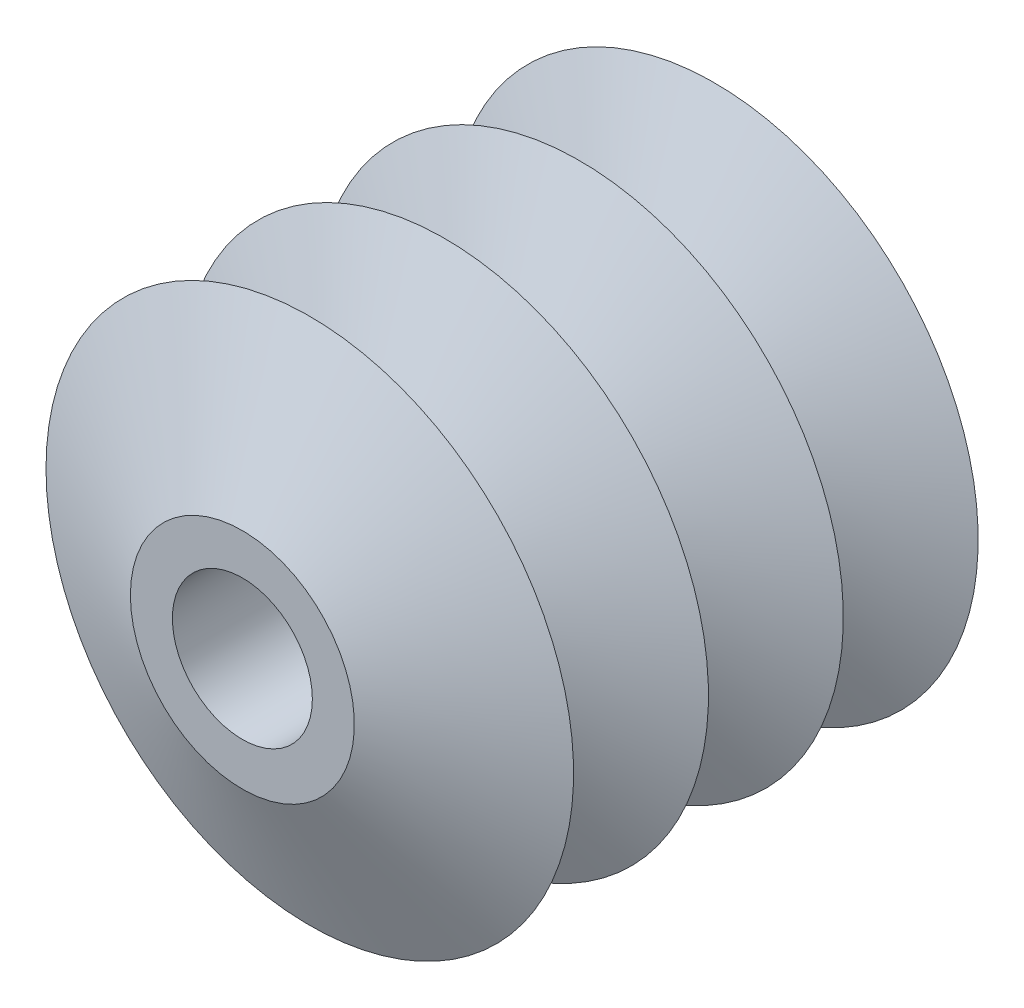
ISO-10303-21;
HEADER;
FILE_DESCRIPTION(('STEP AP214'),'2;1');
FILE_NAME('part.step','',(''),(''),'','','');
FILE_SCHEMA(('AUTOMOTIVE_DESIGN { 1 0 10303 214 1 1 1 1 }'));
ENDSEC;
DATA;
#1=APPLICATION_CONTEXT('core data for automotive mechanical design processes');
#2=APPLICATION_PROTOCOL_DEFINITION('international standard','automotive_design',2000,#1);
#3=PRODUCT_CONTEXT('',#1,'mechanical');
#4=PRODUCT('Part','Part','',(#3));
#5=PRODUCT_RELATED_PRODUCT_CATEGORY('part','',(#4));
#6=PRODUCT_DEFINITION_FORMATION('','',#4);
#7=PRODUCT_DEFINITION_CONTEXT('part definition',#1,'design');
#8=PRODUCT_DEFINITION('design','',#6,#7);
#9=PRODUCT_DEFINITION_SHAPE('','',#8);
#10=(LENGTH_UNIT() NAMED_UNIT(*) SI_UNIT(.MILLI.,.METRE.));
#11=(NAMED_UNIT(*) PLANE_ANGLE_UNIT() SI_UNIT($,.RADIAN.));
#12=(NAMED_UNIT(*) SI_UNIT($,.STERADIAN.) SOLID_ANGLE_UNIT());
#13=UNCERTAINTY_MEASURE_WITH_UNIT(LENGTH_MEASURE(1.E-05),#10,'distance_accuracy_value','');
#14=(GEOMETRIC_REPRESENTATION_CONTEXT(3) GLOBAL_UNCERTAINTY_ASSIGNED_CONTEXT((#13)) GLOBAL_UNIT_ASSIGNED_CONTEXT((#10,
#11,#12)) REPRESENTATION_CONTEXT('',''));
#15=CARTESIAN_POINT('',(0.,0.,0.));
#16=DIRECTION('',(0.,0.,1.));
#17=DIRECTION('',(1.,0.,0.));
#18=AXIS2_PLACEMENT_3D('',#15,#16,#17);
#19=CARTESIAN_POINT('',(0.,0.,33.7212792445425));
#20=DIRECTION('',(0.,0.,-1.));
#21=DIRECTION('',(-1.,0.,0.));
#22=AXIS2_PLACEMENT_3D('',#19,#20,#21);
#23=CONICAL_SURFACE('',#22,14.,1.15280686729455);
#24=CARTESIAN_POINT('',(0.,0.,25.2909594334068));
#25=DIRECTION('',(0.,0.,-1.));
#26=DIRECTION('',(-1.,0.,0.));
#27=AXIS2_PLACEMENT_3D('',#24,#25,#26);
#28=CIRCLE('',#27,32.9802298533417);
#29=CARTESIAN_POINT('',(-32.9802298533416,0.,25.2909594334068));
#30=VERTEX_POINT('',#29);
#31=EDGE_CURVE('E62',#30,#30,#28,.T.);
#32=ORIENTED_EDGE('',*,*,#31,.F.);
#33=EDGE_LOOP('',(#32));
#34=FACE_BOUND('',#33,.T.);
#35=CARTESIAN_POINT('',(0.,0.,33.7212792445425));
#36=DIRECTION('',(0.,0.,-1.));
#37=DIRECTION('',(-1.,0.,0.));
#38=AXIS2_PLACEMENT_3D('',#35,#36,#37);
#39=CIRCLE('',#38,14.);
#40=CARTESIAN_POINT('',(-14.,0.,33.7212792445425));
#41=VERTEX_POINT('',#40);
#42=EDGE_CURVE('E10',#41,#41,#39,.T.);
#43=ORIENTED_EDGE('',*,*,#42,.T.);
#44=EDGE_LOOP('',(#43));
#45=FACE_BOUND('',#44,.T.);
#46=ADVANCED_FACE('F31',(#34,#45),#23,.T.);
#47=CARTESIAN_POINT('',(0.,0.,33.7212792445425));
#48=DIRECTION('',(0.,0.,-1.));
#49=DIRECTION('',(-1.,0.,0.));
#50=AXIS2_PLACEMENT_3D('',#47,#48,#49);
#51=PLANE('',#50);
#52=CARTESIAN_POINT('',(0.,0.129582740590765,33.7212792445425));
#53=DIRECTION('',(0.,0.,1.));
#54=DIRECTION('',(1.,0.,0.));
#55=AXIS2_PLACEMENT_3D('',#52,#53,#54);
#56=CIRCLE('',#55,8.74999999999999);
#57=CARTESIAN_POINT('',(8.74999999999999,0.129582740590765,33.7212792445425));
#58=VERTEX_POINT('',#57);
#59=EDGE_CURVE('E68',#58,#58,#56,.T.);
#60=ORIENTED_EDGE('',*,*,#59,.F.);
#61=EDGE_LOOP('',(#60));
#62=FACE_BOUND('',#61,.T.);
#63=ORIENTED_EDGE('',*,*,#42,.F.);
#64=EDGE_LOOP('',(#63));
#65=FACE_BOUND('',#64,.T.);
#66=ADVANCED_FACE('F74',(#62,#65),#51,.F.);
#67=CARTESIAN_POINT('',(0.,0.,-33.7212792445425));
#68=DIRECTION('',(0.,0.,1.));
#69=DIRECTION('',(1.,0.,0.));
#70=AXIS2_PLACEMENT_3D('',#67,#68,#69);
#71=PLANE('',#70);
#72=CARTESIAN_POINT('',(0.,0.129582740590765,-33.7212792445425));
#73=DIRECTION('',(0.,0.,1.));
#74=DIRECTION('',(1.,0.,0.));
#75=AXIS2_PLACEMENT_3D('',#72,#73,#74);
#76=CIRCLE('',#75,8.74999999999999);
#77=CARTESIAN_POINT('',(8.74999999999999,0.129582740590765,-33.7212792445425));
#78=VERTEX_POINT('',#77);
#79=EDGE_CURVE('E65',#78,#78,#76,.T.);
#80=ORIENTED_EDGE('',*,*,#79,.T.);
#81=EDGE_LOOP('',(#80));
#82=FACE_BOUND('',#81,.T.);
#83=CARTESIAN_POINT('',(0.,0.,-33.7212792445425));
#84=DIRECTION('',(0.,0.,-1.));
#85=DIRECTION('',(-1.,0.,0.));
#86=AXIS2_PLACEMENT_3D('',#83,#84,#85);
#87=CIRCLE('',#86,14.);
#88=CARTESIAN_POINT('',(-14.,0.,-33.7212792445425));
#89=VERTEX_POINT('',#88);
#90=EDGE_CURVE('E37',#89,#89,#87,.T.);
#91=ORIENTED_EDGE('',*,*,#90,.T.);
#92=EDGE_LOOP('',(#91));
#93=FACE_BOUND('',#92,.T.);
#94=ADVANCED_FACE('F77',(#82,#93),#71,.F.);
#95=CARTESIAN_POINT('',(0.,0.,-25.2909594334068));
#96=DIRECTION('',(0.,0.,1.));
#97=DIRECTION('',(1.,0.,0.));
#98=AXIS2_PLACEMENT_3D('',#95,#96,#97);
#99=CONICAL_SURFACE('',#98,32.9802298533417,1.15280686729455);
#100=ORIENTED_EDGE('',*,*,#90,.F.);
#101=EDGE_LOOP('',(#100));
#102=FACE_BOUND('',#101,.T.);
#103=CARTESIAN_POINT('',(0.,0.,-25.2909594334068));
#104=DIRECTION('',(0.,0.,-1.));
#105=DIRECTION('',(-1.,0.,0.));
#106=AXIS2_PLACEMENT_3D('',#103,#104,#105);
#107=CIRCLE('',#106,32.9802298533417);
#108=CARTESIAN_POINT('',(-32.9802298533416,0.,-25.2909594334068));
#109=VERTEX_POINT('',#108);
#110=EDGE_CURVE('E41',#109,#109,#107,.T.);
#111=ORIENTED_EDGE('',*,*,#110,.T.);
#112=EDGE_LOOP('',(#111));
#113=FACE_BOUND('',#112,.T.);
#114=ADVANCED_FACE('F82',(#102,#113),#99,.T.);
#115=CARTESIAN_POINT('',(0.,0.,-16.8606396222712));
#116=DIRECTION('',(0.,0.,-1.));
#117=DIRECTION('',(-1.,0.,0.));
#118=AXIS2_PLACEMENT_3D('',#115,#116,#117);
#119=CONICAL_SURFACE('',#118,14.,1.15280686729455);
#120=ORIENTED_EDGE('',*,*,#110,.F.);
#121=EDGE_LOOP('',(#120));
#122=FACE_BOUND('',#121,.T.);
#123=CARTESIAN_POINT('',(0.,0.,-16.8606396222712));
#124=DIRECTION('',(0.,0.,-1.));
#125=DIRECTION('',(-1.,0.,0.));
#126=AXIS2_PLACEMENT_3D('',#123,#124,#125);
#127=CIRCLE('',#126,14.);
#128=CARTESIAN_POINT('',(-14.,0.,-16.8606396222712));
#129=VERTEX_POINT('',#128);
#130=EDGE_CURVE('E45',#129,#129,#127,.T.);
#131=ORIENTED_EDGE('',*,*,#130,.T.);
#132=EDGE_LOOP('',(#131));
#133=FACE_BOUND('',#132,.T.);
#134=ADVANCED_FACE('F89',(#122,#133),#119,.T.);
#135=CARTESIAN_POINT('',(0.,0.,-8.43031981113562));
#136=DIRECTION('',(0.,0.,1.));
#137=DIRECTION('',(1.,0.,0.));
#138=AXIS2_PLACEMENT_3D('',#135,#136,#137);
#139=CONICAL_SURFACE('',#138,32.9802298533417,1.15280686729455);
#140=ORIENTED_EDGE('',*,*,#130,.F.);
#141=EDGE_LOOP('',(#140));
#142=FACE_BOUND('',#141,.T.);
#143=CARTESIAN_POINT('',(0.,0.,-8.43031981113562));
#144=DIRECTION('',(0.,0.,-1.));
#145=DIRECTION('',(-1.,0.,0.));
#146=AXIS2_PLACEMENT_3D('',#143,#144,#145);
#147=CIRCLE('',#146,32.9802298533417);
#148=CARTESIAN_POINT('',(-32.9802298533416,0.,-8.43031981113562));
#149=VERTEX_POINT('',#148);
#150=EDGE_CURVE('E50',#149,#149,#147,.T.);
#151=ORIENTED_EDGE('',*,*,#150,.T.);
#152=EDGE_LOOP('',(#151));
#153=FACE_BOUND('',#152,.T.);
#154=ADVANCED_FACE('F93',(#142,#153),#139,.T.);
#155=CARTESIAN_POINT('',(0.,0.,0.));
#156=DIRECTION('',(0.,0.,-1.));
#157=DIRECTION('',(-1.,0.,0.));
#158=AXIS2_PLACEMENT_3D('',#155,#156,#157);
#159=CONICAL_SURFACE('',#158,14.,1.15280686729455);
#160=ORIENTED_EDGE('',*,*,#150,.F.);
#161=EDGE_LOOP('',(#160));
#162=FACE_BOUND('',#161,.T.);
#163=CARTESIAN_POINT('',(0.,0.,0.));
#164=DIRECTION('',(0.,0.,-1.));
#165=DIRECTION('',(-1.,0.,0.));
#166=AXIS2_PLACEMENT_3D('',#163,#164,#165);
#167=CIRCLE('',#166,14.);
#168=CARTESIAN_POINT('',(-14.,0.,0.));
#169=VERTEX_POINT('',#168);
#170=EDGE_CURVE('E53',#169,#169,#167,.T.);
#171=ORIENTED_EDGE('',*,*,#170,.T.);
#172=EDGE_LOOP('',(#171));
#173=FACE_BOUND('',#172,.T.);
#174=ADVANCED_FACE('F97',(#162,#173),#159,.T.);
#175=CARTESIAN_POINT('',(0.,0.,8.43031981113561));
#176=DIRECTION('',(0.,0.,1.));
#177=DIRECTION('',(1.,0.,0.));
#178=AXIS2_PLACEMENT_3D('',#175,#176,#177);
#179=CONICAL_SURFACE('',#178,32.9802298533417,1.15280686729455);
#180=ORIENTED_EDGE('',*,*,#170,.F.);
#181=EDGE_LOOP('',(#180));
#182=FACE_BOUND('',#181,.T.);
#183=CARTESIAN_POINT('',(0.,0.,8.43031981113561));
#184=DIRECTION('',(0.,0.,-1.));
#185=DIRECTION('',(-1.,0.,0.));
#186=AXIS2_PLACEMENT_3D('',#183,#184,#185);
#187=CIRCLE('',#186,32.9802298533417);
#188=CARTESIAN_POINT('',(-32.9802298533416,0.,8.43031981113561));
#189=VERTEX_POINT('',#188);
#190=EDGE_CURVE('E56',#189,#189,#187,.T.);
#191=ORIENTED_EDGE('',*,*,#190,.T.);
#192=EDGE_LOOP('',(#191));
#193=FACE_BOUND('',#192,.T.);
#194=ADVANCED_FACE('F101',(#182,#193),#179,.T.);
#195=CARTESIAN_POINT('',(0.,0.,16.8606396222712));
#196=DIRECTION('',(0.,0.,-1.));
#197=DIRECTION('',(-1.,0.,0.));
#198=AXIS2_PLACEMENT_3D('',#195,#196,#197);
#199=CONICAL_SURFACE('',#198,14.,1.15280686729455);
#200=ORIENTED_EDGE('',*,*,#190,.F.);
#201=EDGE_LOOP('',(#200));
#202=FACE_BOUND('',#201,.T.);
#203=CARTESIAN_POINT('',(0.,0.,16.8606396222712));
#204=DIRECTION('',(0.,0.,-1.));
#205=DIRECTION('',(-1.,0.,0.));
#206=AXIS2_PLACEMENT_3D('',#203,#204,#205);
#207=CIRCLE('',#206,14.);
#208=CARTESIAN_POINT('',(-14.,0.,16.8606396222712));
#209=VERTEX_POINT('',#208);
#210=EDGE_CURVE('E59',#209,#209,#207,.T.);
#211=ORIENTED_EDGE('',*,*,#210,.T.);
#212=EDGE_LOOP('',(#211));
#213=FACE_BOUND('',#212,.T.);
#214=ADVANCED_FACE('F105',(#202,#213),#199,.T.);
#215=CARTESIAN_POINT('',(0.,0.,25.2909594334068));
#216=DIRECTION('',(0.,0.,1.));
#217=DIRECTION('',(1.,0.,0.));
#218=AXIS2_PLACEMENT_3D('',#215,#216,#217);
#219=CONICAL_SURFACE('',#218,32.9802298533417,1.15280686729455);
#220=ORIENTED_EDGE('',*,*,#210,.F.);
#221=EDGE_LOOP('',(#220));
#222=FACE_BOUND('',#221,.T.);
#223=ORIENTED_EDGE('',*,*,#31,.T.);
#224=EDGE_LOOP('',(#223));
#225=FACE_BOUND('',#224,.T.);
#226=ADVANCED_FACE('F109',(#222,#225),#219,.T.);
#227=CARTESIAN_POINT('',(0.,0.129582740590765,33.7212792445425));
#228=DIRECTION('',(0.,0.,1.));
#229=DIRECTION('',(1.,0.,0.));
#230=AXIS2_PLACEMENT_3D('',#227,#228,#229);
#231=CYLINDRICAL_SURFACE('',#230,8.74999999999999);
#232=ORIENTED_EDGE('',*,*,#79,.F.);
#233=EDGE_LOOP('',(#232));
#234=FACE_BOUND('',#233,.T.);
#235=ORIENTED_EDGE('',*,*,#59,.T.);
#236=EDGE_LOOP('',(#235));
#237=FACE_BOUND('',#236,.T.);
#238=ADVANCED_FACE('F72',(#234,#237),#231,.F.);
#239=CLOSED_SHELL('',(#46,#66,#94,#114,#134,#154,#174,#194,#214,#226,#238));
#240=MANIFOLD_SOLID_BREP('B2',#239);
#241=ADVANCED_BREP_SHAPE_REPRESENTATION('',(#18,#240),#14);
#242=SHAPE_DEFINITION_REPRESENTATION(#9,#241);
ENDSEC;
END-ISO-10303-21;
